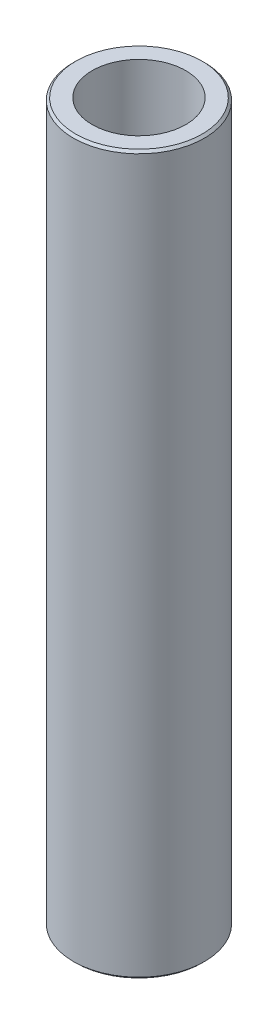
ISO-10303-21;
HEADER;
FILE_DESCRIPTION(('STEP AP214'),'2;1');
FILE_NAME('part.step','',(''),(''),'','','');
FILE_SCHEMA(('AUTOMOTIVE_DESIGN { 1 0 10303 214 1 1 1 1 }'));
ENDSEC;
DATA;
#1=APPLICATION_CONTEXT('core data for automotive mechanical design processes');
#2=APPLICATION_PROTOCOL_DEFINITION('international standard','automotive_design',2000,#1);
#3=PRODUCT_CONTEXT('',#1,'mechanical');
#4=PRODUCT('Part','Part','',(#3));
#5=PRODUCT_RELATED_PRODUCT_CATEGORY('part','',(#4));
#6=PRODUCT_DEFINITION_FORMATION('','',#4);
#7=PRODUCT_DEFINITION_CONTEXT('part definition',#1,'design');
#8=PRODUCT_DEFINITION('design','',#6,#7);
#9=PRODUCT_DEFINITION_SHAPE('','',#8);
#10=(LENGTH_UNIT() NAMED_UNIT(*) SI_UNIT(.MILLI.,.METRE.));
#11=(NAMED_UNIT(*) PLANE_ANGLE_UNIT() SI_UNIT($,.RADIAN.));
#12=(NAMED_UNIT(*) SI_UNIT($,.STERADIAN.) SOLID_ANGLE_UNIT());
#13=UNCERTAINTY_MEASURE_WITH_UNIT(LENGTH_MEASURE(1.E-05),#10,'distance_accuracy_value','');
#14=(GEOMETRIC_REPRESENTATION_CONTEXT(3) GLOBAL_UNCERTAINTY_ASSIGNED_CONTEXT((#13)) GLOBAL_UNIT_ASSIGNED_CONTEXT((#10,
#11,#12)) REPRESENTATION_CONTEXT('',''));
#15=CARTESIAN_POINT('',(0.,0.,0.));
#16=DIRECTION('',(0.,0.,1.));
#17=DIRECTION('',(1.,0.,0.));
#18=AXIS2_PLACEMENT_3D('',#15,#16,#17);
#19=CARTESIAN_POINT('',(0.,574.83595254542,0.));
#20=DIRECTION('',(0.,-1.,0.));
#21=DIRECTION('',(0.,0.,-1.));
#22=AXIS2_PLACEMENT_3D('',#19,#20,#21);
#23=CYLINDRICAL_SURFACE('',#22,52.5);
#24=CARTESIAN_POINT('',(0.,572.95704609696,0.));
#25=DIRECTION('',(0.,1.,0.));
#26=DIRECTION('',(0.,0.,1.));
#27=AXIS2_PLACEMENT_3D('',#24,#25,#26);
#28=CIRCLE('',#27,52.5);
#29=CARTESIAN_POINT('',(0.,572.95704609696,52.5));
#30=VERTEX_POINT('',#29);
#31=EDGE_CURVE('E50',#30,#30,#28,.F.);
#32=ORIENTED_EDGE('',*,*,#31,.T.);
#33=EDGE_LOOP('',(#32));
#34=FACE_BOUND('',#33,.T.);
#35=CARTESIAN_POINT('',(0.,1.87890644846023,0.));
#36=DIRECTION('',(0.,1.,0.));
#37=DIRECTION('',(0.,0.,1.));
#38=AXIS2_PLACEMENT_3D('',#35,#36,#37);
#39=CIRCLE('',#38,52.5);
#40=CARTESIAN_POINT('',(0.,1.87890644846023,52.5));
#41=VERTEX_POINT('',#40);
#42=EDGE_CURVE('E51',#41,#41,#39,.T.);
#43=ORIENTED_EDGE('',*,*,#42,.T.);
#44=EDGE_LOOP('',(#43));
#45=FACE_BOUND('',#44,.T.);
#46=ADVANCED_FACE('F39',(#34,#45),#23,.T.);
#47=CARTESIAN_POINT('',(0.,574.83595254542,0.));
#48=DIRECTION('',(0.,1.,0.));
#49=DIRECTION('',(0.,0.,1.));
#50=AXIS2_PLACEMENT_3D('',#47,#48,#49);
#51=PLANE('',#50);
#52=CARTESIAN_POINT('',(0.,574.83595254542,0.));
#53=DIRECTION('',(0.,1.,0.));
#54=DIRECTION('',(0.,0.,1.));
#55=AXIS2_PLACEMENT_3D('',#52,#53,#54);
#56=CIRCLE('',#55,50.6210935515397);
#57=CARTESIAN_POINT('',(0.,574.83595254542,50.6210935515397));
#58=VERTEX_POINT('',#57);
#59=EDGE_CURVE('E54',#58,#58,#56,.T.);
#60=ORIENTED_EDGE('',*,*,#59,.T.);
#61=EDGE_LOOP('',(#60));
#62=FACE_BOUND('',#61,.T.);
#63=CARTESIAN_POINT('',(0.,574.83595254542,0.));
#64=DIRECTION('',(0.,1.,0.));
#65=DIRECTION('',(0.,0.,1.));
#66=AXIS2_PLACEMENT_3D('',#63,#64,#65);
#67=CIRCLE('',#66,37.4941761482006);
#68=CARTESIAN_POINT('',(0.,574.83595254542,37.4941761482006));
#69=VERTEX_POINT('',#68);
#70=EDGE_CURVE('E58',#69,#69,#67,.T.);
#71=ORIENTED_EDGE('',*,*,#70,.F.);
#72=EDGE_LOOP('',(#71));
#73=FACE_BOUND('',#72,.T.);
#74=ADVANCED_FACE('F69',(#62,#73),#51,.T.);
#75=CARTESIAN_POINT('',(0.,0.,0.));
#76=DIRECTION('',(0.,1.,0.));
#77=DIRECTION('',(0.,0.,1.));
#78=AXIS2_PLACEMENT_3D('',#75,#76,#77);
#79=PLANE('',#78);
#80=CARTESIAN_POINT('',(0.,0.,0.));
#81=DIRECTION('',(0.,1.,0.));
#82=DIRECTION('',(0.,0.,1.));
#83=AXIS2_PLACEMENT_3D('',#80,#81,#82);
#84=CIRCLE('',#83,50.6210935515397);
#85=CARTESIAN_POINT('',(0.,0.,50.6210935515397));
#86=VERTEX_POINT('',#85);
#87=EDGE_CURVE('E10',#86,#86,#84,.F.);
#88=ORIENTED_EDGE('',*,*,#87,.T.);
#89=EDGE_LOOP('',(#88));
#90=FACE_BOUND('',#89,.T.);
#91=CARTESIAN_POINT('',(0.,0.,0.));
#92=DIRECTION('',(0.,1.,0.));
#93=DIRECTION('',(0.,0.,1.));
#94=AXIS2_PLACEMENT_3D('',#91,#92,#93);
#95=CIRCLE('',#94,37.4941761482006);
#96=CARTESIAN_POINT('',(0.,0.,37.4941761482006));
#97=VERTEX_POINT('',#96);
#98=EDGE_CURVE('E63',#97,#97,#95,.T.);
#99=ORIENTED_EDGE('',*,*,#98,.T.);
#100=EDGE_LOOP('',(#99));
#101=FACE_BOUND('',#100,.T.);
#102=ADVANCED_FACE('F75',(#90,#101),#79,.F.);
#103=CARTESIAN_POINT('',(0.,574.83595254542,0.));
#104=DIRECTION('',(0.,-1.,0.));
#105=DIRECTION('',(0.,0.,-1.));
#106=AXIS2_PLACEMENT_3D('',#103,#104,#105);
#107=CYLINDRICAL_SURFACE('',#106,37.4941761482006);
#108=ORIENTED_EDGE('',*,*,#70,.T.);
#109=EDGE_LOOP('',(#108));
#110=FACE_BOUND('',#109,.T.);
#111=ORIENTED_EDGE('',*,*,#98,.F.);
#112=EDGE_LOOP('',(#111));
#113=FACE_BOUND('',#112,.T.);
#114=ADVANCED_FACE('F70',(#110,#113),#107,.F.);
#115=CARTESIAN_POINT('',(0.,574.83595254542,0.));
#116=DIRECTION('',(0.,-1.,0.));
#117=DIRECTION('',(0.,0.,-1.));
#118=AXIS2_PLACEMENT_3D('',#115,#116,#117);
#119=CONICAL_SURFACE('',#118,50.6210935515397,0.785398163397437);
#120=ORIENTED_EDGE('',*,*,#31,.F.);
#121=EDGE_LOOP('',(#120));
#122=FACE_BOUND('',#121,.T.);
#123=ORIENTED_EDGE('',*,*,#59,.F.);
#124=EDGE_LOOP('',(#123));
#125=FACE_BOUND('',#124,.T.);
#126=ADVANCED_FACE('F81',(#122,#125),#119,.T.);
#127=CARTESIAN_POINT('',(0.,1.87890644846023,0.));
#128=DIRECTION('',(0.,1.,0.));
#129=DIRECTION('',(0.,0.,1.));
#130=AXIS2_PLACEMENT_3D('',#127,#128,#129);
#131=CONICAL_SURFACE('',#130,52.5,0.785398163397465);
#132=CARTESIAN_POINT('',(0.,0.,50.6210935515397));
#133=CARTESIAN_POINT('',(0.,0.0195719421714588,50.6406654937112));
#134=CARTESIAN_POINT('',(0.,0.0391438843429201,50.6602374358826));
#135=CARTESIAN_POINT('',(0.,0.0782877686858425,50.6993813202256));
#136=CARTESIAN_POINT('',(0.,0.0978597108573038,50.718953262397));
#137=CARTESIAN_POINT('',(0.,0.137003595200225,50.7580971467399));
#138=CARTESIAN_POINT('',(0.,0.156575537371686,50.7776690889114));
#139=CARTESIAN_POINT('',(0.,0.195719421714607,50.8168129732543));
#140=CARTESIAN_POINT('',(0.,0.215291363886067,50.8363849154258));
#141=CARTESIAN_POINT('',(0.,0.254435248228989,50.8755287997687));
#142=CARTESIAN_POINT('',(0.,0.27400719040045,50.8951007419402));
#143=CARTESIAN_POINT('',(0.,0.313151074743371,50.9342446262831));
#144=CARTESIAN_POINT('',(0.,0.332723016914831,50.9538165684546));
#145=CARTESIAN_POINT('',(0.,0.371866901257753,50.9929604527975));
#146=CARTESIAN_POINT('',(0.,0.391438843429214,51.0125323949689));
#147=CARTESIAN_POINT('',(0.,0.430582727772136,51.0516762793119));
#148=CARTESIAN_POINT('',(0.,0.450154669943596,51.0712482214833));
#149=CARTESIAN_POINT('',(0.,0.489298554286517,51.1103921058262));
#150=CARTESIAN_POINT('',(0.,0.508870496457978,51.1299640479977));
#151=CARTESIAN_POINT('',(0.,0.548014380800899,51.1691079323406));
#152=CARTESIAN_POINT('',(0.,0.56758632297236,51.1886798745121));
#153=CARTESIAN_POINT('',(0.,0.606730207315281,51.227823758855));
#154=CARTESIAN_POINT('',(0.,0.626302149486741,51.2473957010265));
#155=CARTESIAN_POINT('',(0.,0.665446033829663,51.2865395853694));
#156=CARTESIAN_POINT('',(0.,0.685017976001125,51.3061115275408));
#157=CARTESIAN_POINT('',(0.,0.724161860344047,51.3452554118838));
#158=CARTESIAN_POINT('',(0.,0.743733802515507,51.3648273540552));
#159=CARTESIAN_POINT('',(0.,0.782877686858428,51.4039712383982));
#160=CARTESIAN_POINT('',(0.,0.802449629029889,51.4235431805696));
#161=CARTESIAN_POINT('',(0.,0.84159351337281,51.4626870649126));
#162=CARTESIAN_POINT('',(0.,0.86116545554427,51.482259007084));
#163=CARTESIAN_POINT('',(0.,0.900309339887192,51.5214028914269));
#164=CARTESIAN_POINT('',(0.,0.919881282058653,51.5409748335984));
#165=CARTESIAN_POINT('',(0.,0.959025166401575,51.5801187179413));
#166=CARTESIAN_POINT('',(0.,0.978597108573035,51.5996906601128));
#167=CARTESIAN_POINT('',(0.,1.01774099291596,51.6388345444557));
#168=CARTESIAN_POINT('',(0.,1.03731293508742,51.6584064866272));
#169=CARTESIAN_POINT('',(0.,1.07645681943034,51.6975503709701));
#170=CARTESIAN_POINT('',(0.,1.0960287616018,51.7171223131415));
#171=CARTESIAN_POINT('',(0.,1.13517264594472,51.7562661974845));
#172=CARTESIAN_POINT('',(0.,1.15474458811618,51.7758381396559));
#173=CARTESIAN_POINT('',(0.,1.1938884724591,51.8149820239989));
#174=CARTESIAN_POINT('',(0.,1.21346041463056,51.8345539661703));
#175=CARTESIAN_POINT('',(0.,1.25260429897349,51.8736978505132));
#176=CARTESIAN_POINT('',(0.,1.27217624114495,51.8932697926847));
#177=CARTESIAN_POINT('',(0.,1.31132012548787,51.9324136770276));
#178=CARTESIAN_POINT('',(0.,1.33089206765933,51.9519856191991));
#179=CARTESIAN_POINT('',(0.,1.37003595200225,51.991129503542));
#180=CARTESIAN_POINT('',(0.,1.38960789417371,52.0107014457135));
#181=CARTESIAN_POINT('',(0.,1.42875177851663,52.0498453300564));
#182=CARTESIAN_POINT('',(0.,1.44832372068809,52.0694172722279));
#183=CARTESIAN_POINT('',(0.,1.48746760503101,52.1085611565708));
#184=CARTESIAN_POINT('',(0.,1.50703954720247,52.1281330987422));
#185=CARTESIAN_POINT('',(0.,1.5461834315454,52.1672769830852));
#186=CARTESIAN_POINT('',(0.,1.56575537371686,52.1868489252566));
#187=CARTESIAN_POINT('',(0.,1.60489925805978,52.2259928095995));
#188=CARTESIAN_POINT('',(0.,1.62447120023124,52.245564751771));
#189=CARTESIAN_POINT('',(0.,1.66361508457416,52.2847086361139));
#190=CARTESIAN_POINT('',(0.,1.68318702674562,52.3042805782854));
#191=CARTESIAN_POINT('',(0.,1.72233091108854,52.3434244626283));
#192=CARTESIAN_POINT('',(0.,1.74190285326,52.3629964047998));
#193=CARTESIAN_POINT('',(0.,1.78104673760292,52.4021402891427));
#194=CARTESIAN_POINT('',(0.,1.80061867977438,52.4217122313142));
#195=CARTESIAN_POINT('',(0.,1.83976256411731,52.4608561156571));
#196=CARTESIAN_POINT('',(0.,1.85933450628877,52.4804280578285));
#197=CARTESIAN_POINT('',(0.,1.87890644846023,52.5));
#198=B_SPLINE_CURVE_WITH_KNOTS('',3,(#132,#133,#134,#135,#136,#137,#138,#139,#140,#141,#142,
#143,#144,#145,#146,#147,#148,#149,#150,#151,#152,#153,#154,#155,#156,#157,#158,#159,#160,#161,
#162,#163,#164,#165,#166,#167,#168,#169,#170,#171,#172,#173,#174,#175,#176,#177,#178,#179,#180,
#181,#182,#183,#184,#185,#186,#187,#188,#189,#190,#191,#192,#193,#194,#195,#196,#197),
.UNSPECIFIED.,.F.,.F.,(4,2,2,2,2,2,2,2,2,2,2,2,2,2,2,2,2,2,2,2,2,2,2,2,2,2,2,2,2,2,2,2,4),(0.,
0.0830367181825874,0.16607343636517,0.249110154547757,0.332146872730345,0.415183590912932,
0.498220309095519,0.581257027278102,0.664293745460689,0.747330463643277,0.830367181825864,
0.913403900008452,0.996440618191034,1.07947733637362,1.16251405455621,1.2455507727388,
1.32858749092138,1.41162420910397,1.49466092728655,1.57769764546914,1.66073436365173,
1.74377108183431,1.8268078000169,1.90984451819949,1.99288123638207,2.07591795456466,
2.15895467274724,2.24199139092983,2.32502810911242,2.40806482729501,2.49110154547759,
2.57413826366018,2.65717498184276),.UNSPECIFIED.);
#199=EDGE_CURVE('BSEAM45',#86,#41,#198,.T.);
#200=ORIENTED_EDGE('',*,*,#87,.F.);
#201=ORIENTED_EDGE('',*,*,#42,.F.);
#202=ORIENTED_EDGE('',*,*,#199,.T.);
#203=ORIENTED_EDGE('',*,*,#199,.F.);
#204=EDGE_LOOP('',(#200,#202,#201,#203));
#205=FACE_BOUND('',#204,.T.);
#206=ADVANCED_FACE('F45',(#205),#131,.T.);
#207=CLOSED_SHELL('',(#46,#74,#102,#114,#126,#206));
#208=MANIFOLD_SOLID_BREP('B2',#207);
#209=ADVANCED_BREP_SHAPE_REPRESENTATION('',(#18,#208),#14);
#210=SHAPE_DEFINITION_REPRESENTATION(#9,#209);
ENDSEC;
END-ISO-10303-21;
